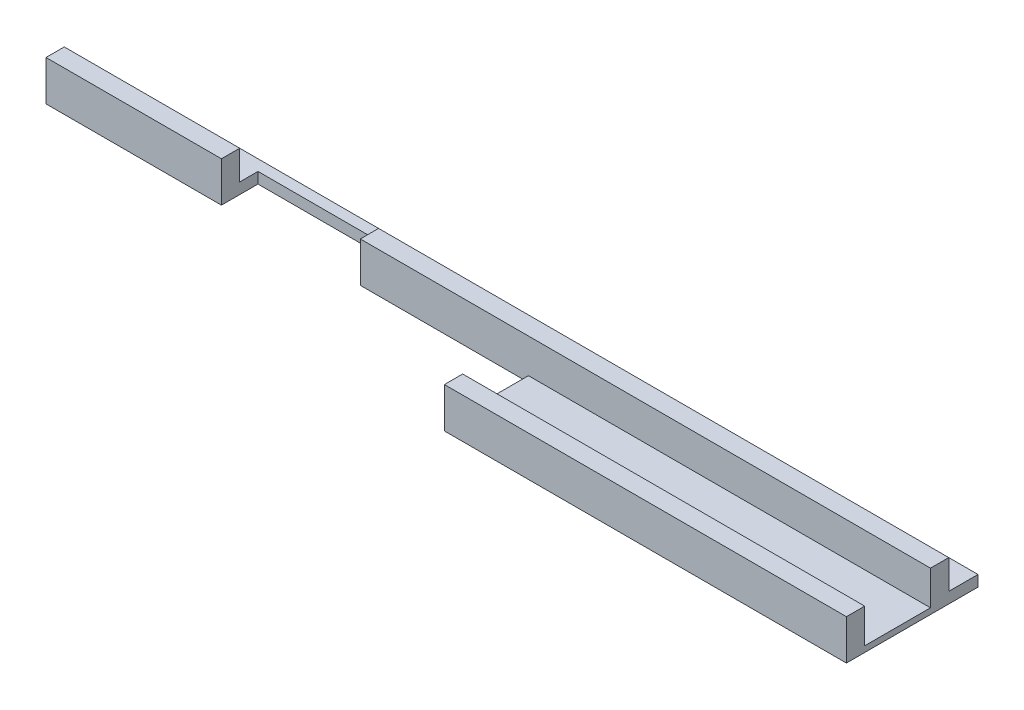
ISO-10303-21;
HEADER;
FILE_DESCRIPTION(('STEP AP214'),'2;1');
FILE_NAME('part.step','',(''),(''),'','','');
FILE_SCHEMA(('AUTOMOTIVE_DESIGN { 1 0 10303 214 1 1 1 1 }'));
ENDSEC;
DATA;
#1=APPLICATION_CONTEXT('core data for automotive mechanical design processes');
#2=APPLICATION_PROTOCOL_DEFINITION('international standard','automotive_design',2000,#1);
#3=PRODUCT_CONTEXT('',#1,'mechanical');
#4=PRODUCT('Part','Part','',(#3));
#5=PRODUCT_RELATED_PRODUCT_CATEGORY('part','',(#4));
#6=PRODUCT_DEFINITION_FORMATION('','',#4);
#7=PRODUCT_DEFINITION_CONTEXT('part definition',#1,'design');
#8=PRODUCT_DEFINITION('design','',#6,#7);
#9=PRODUCT_DEFINITION_SHAPE('','',#8);
#10=(LENGTH_UNIT() NAMED_UNIT(*) SI_UNIT(.MILLI.,.METRE.));
#11=(NAMED_UNIT(*) PLANE_ANGLE_UNIT() SI_UNIT($,.RADIAN.));
#12=(NAMED_UNIT(*) SI_UNIT($,.STERADIAN.) SOLID_ANGLE_UNIT());
#13=UNCERTAINTY_MEASURE_WITH_UNIT(LENGTH_MEASURE(1.E-05),#10,'distance_accuracy_value','');
#14=(GEOMETRIC_REPRESENTATION_CONTEXT(3) GLOBAL_UNCERTAINTY_ASSIGNED_CONTEXT((#13)) GLOBAL_UNIT_ASSIGNED_CONTEXT((#10,
#11,#12)) REPRESENTATION_CONTEXT('',''));
#15=CARTESIAN_POINT('',(0.,0.,0.));
#16=DIRECTION('',(0.,0.,1.));
#17=DIRECTION('',(1.,0.,0.));
#18=AXIS2_PLACEMENT_3D('',#15,#16,#17);
#19=CARTESIAN_POINT('',(-60.,3.,68.5));
#20=DIRECTION('',(0.,0.,-1.));
#21=DIRECTION('',(-1.,0.,0.));
#22=AXIS2_PLACEMENT_3D('',#19,#20,#21);
#23=PLANE('',#22);
#24=DIRECTION('',(1.,0.,0.));
#25=VECTOR('',#24,1.);
#26=CARTESIAN_POINT('',(-60.,0.,68.5));
#27=LINE('',#26,#25);
#28=CARTESIAN_POINT('',(-67.,0.,68.5));
#29=VERTEX_POINT('',#28);
#30=CARTESIAN_POINT('',(-19.,0.,68.5));
#31=VERTEX_POINT('',#30);
#32=EDGE_CURVE('E204',#29,#31,#27,.T.);
#33=ORIENTED_EDGE('',*,*,#32,.T.);
#34=DIRECTION('',(0.,1.,0.));
#35=VECTOR('',#34,1.);
#36=CARTESIAN_POINT('',(-19.,-14.,68.5));
#37=LINE('',#36,#35);
#38=CARTESIAN_POINT('',(-19.,11.,68.5));
#39=VERTEX_POINT('',#38);
#40=EDGE_CURVE('E277',#31,#39,#37,.T.);
#41=ORIENTED_EDGE('',*,*,#40,.T.);
#42=DIRECTION('',(1.,0.,0.));
#43=VECTOR('',#42,1.);
#44=CARTESIAN_POINT('',(-60.,11.,68.5));
#45=LINE('',#44,#43);
#46=CARTESIAN_POINT('',(-67.,11.,68.5));
#47=VERTEX_POINT('',#46);
#48=EDGE_CURVE('E265',#47,#39,#45,.T.);
#49=ORIENTED_EDGE('',*,*,#48,.F.);
#50=DIRECTION('',(0.,1.,0.));
#51=VECTOR('',#50,1.);
#52=CARTESIAN_POINT('',(-67.,11.,68.5));
#53=LINE('',#52,#51);
#54=EDGE_CURVE('E296',#29,#47,#53,.T.);
#55=ORIENTED_EDGE('',*,*,#54,.F.);
#56=EDGE_LOOP('',(#33,#41,#49,#55));
#57=FACE_BOUND('',#56,.T.);
#58=ADVANCED_FACE('F39',(#57),#23,.F.);
#59=CARTESIAN_POINT('',(-60.,11.,63.5));
#60=DIRECTION('',(0.,0.,1.));
#61=DIRECTION('',(1.,0.,0.));
#62=AXIS2_PLACEMENT_3D('',#59,#60,#61);
#63=PLANE('',#62);
#64=DIRECTION('',(-1.,0.,0.));
#65=VECTOR('',#64,1.);
#66=CARTESIAN_POINT('',(-60.,11.,63.5));
#67=LINE('',#66,#65);
#68=CARTESIAN_POINT('',(-19.,11.,63.5));
#69=VERTEX_POINT('',#68);
#70=CARTESIAN_POINT('',(-67.,11.,63.5));
#71=VERTEX_POINT('',#70);
#72=EDGE_CURVE('E183',#69,#71,#67,.T.);
#73=ORIENTED_EDGE('',*,*,#72,.F.);
#74=DIRECTION('',(0.,-1.,0.));
#75=VECTOR('',#74,1.);
#76=CARTESIAN_POINT('',(-19.,11.,63.5));
#77=LINE('',#76,#75);
#78=CARTESIAN_POINT('',(-19.,3.,63.5));
#79=VERTEX_POINT('',#78);
#80=EDGE_CURVE('E167',#69,#79,#77,.T.);
#81=ORIENTED_EDGE('',*,*,#80,.T.);
#82=DIRECTION('',(-1.,0.,0.));
#83=VECTOR('',#82,1.);
#84=CARTESIAN_POINT('',(-60.,3.,63.5));
#85=LINE('',#84,#83);
#86=CARTESIAN_POINT('',(-67.,3.,63.5));
#87=VERTEX_POINT('',#86);
#88=EDGE_CURVE('E181',#79,#87,#85,.T.);
#89=ORIENTED_EDGE('',*,*,#88,.T.);
#90=DIRECTION('',(0.,-1.,0.));
#91=VECTOR('',#90,1.);
#92=CARTESIAN_POINT('',(-67.,11.,63.5));
#93=LINE('',#92,#91);
#94=EDGE_CURVE('E310',#71,#87,#93,.T.);
#95=ORIENTED_EDGE('',*,*,#94,.F.);
#96=EDGE_LOOP('',(#73,#81,#89,#95));
#97=FACE_BOUND('',#96,.T.);
#98=ADVANCED_FACE('F179',(#97),#63,.F.);
#99=CARTESIAN_POINT('',(0.,11.,0.));
#100=DIRECTION('',(0.,-1.,0.));
#101=DIRECTION('',(0.,0.,-1.));
#102=AXIS2_PLACEMENT_3D('',#99,#100,#101);
#103=PLANE('',#102);
#104=ORIENTED_EDGE('',*,*,#48,.T.);
#105=DIRECTION('',(0.,0.,-1.));
#106=VECTOR('',#105,1.);
#107=CARTESIAN_POINT('',(-19.,11.,0.));
#108=LINE('',#107,#106);
#109=EDGE_CURVE('E208',#39,#69,#108,.T.);
#110=ORIENTED_EDGE('',*,*,#109,.T.);
#111=ORIENTED_EDGE('',*,*,#72,.T.);
#112=DIRECTION('',(0.,0.,-1.));
#113=VECTOR('',#112,1.);
#114=CARTESIAN_POINT('',(-67.,11.,63.5));
#115=LINE('',#114,#113);
#116=EDGE_CURVE('E313',#47,#71,#115,.T.);
#117=ORIENTED_EDGE('',*,*,#116,.F.);
#118=EDGE_LOOP('',(#104,#110,#111,#117));
#119=FACE_BOUND('',#118,.T.);
#120=ADVANCED_FACE('F378',(#119),#103,.F.);
#121=CARTESIAN_POINT('',(0.,3.,0.));
#122=DIRECTION('',(0.,-1.,0.));
#123=DIRECTION('',(0.,0.,-1.));
#124=AXIS2_PLACEMENT_3D('',#121,#122,#123);
#125=PLANE('',#124);
#126=CARTESIAN_POINT('',(175.,3.,63.5));
#127=VERTEX_POINT('',#126);
#128=CARTESIAN_POINT('',(19.,3.,63.5));
#129=VERTEX_POINT('',#128);
#130=EDGE_CURVE('E192',#127,#129,#85,.T.);
#131=ORIENTED_EDGE('',*,*,#130,.F.);
#132=DIRECTION('',(0.,0.,1.));
#133=VECTOR('',#132,1.);
#134=CARTESIAN_POINT('',(175.,3.,0.));
#135=LINE('',#134,#133);
#136=CARTESIAN_POINT('',(175.,3.,55.5));
#137=VERTEX_POINT('',#136);
#138=EDGE_CURVE('E241',#137,#127,#135,.T.);
#139=ORIENTED_EDGE('',*,*,#138,.F.);
#140=DIRECTION('',(-1.,0.,0.));
#141=VECTOR('',#140,1.);
#142=CARTESIAN_POINT('',(0.,3.,55.5));
#143=LINE('',#142,#141);
#144=CARTESIAN_POINT('',(-67.,3.,55.5));
#145=VERTEX_POINT('',#144);
#146=EDGE_CURVE('E95',#137,#145,#143,.T.);
#147=ORIENTED_EDGE('',*,*,#146,.T.);
#148=DIRECTION('',(0.,0.,-1.));
#149=VECTOR('',#148,1.);
#150=CARTESIAN_POINT('',(-67.,3.,63.5));
#151=LINE('',#150,#149);
#152=EDGE_CURVE('E190',#87,#145,#151,.T.);
#153=ORIENTED_EDGE('',*,*,#152,.F.);
#154=ORIENTED_EDGE('',*,*,#88,.F.);
#155=DIRECTION('',(0.,0.,-1.));
#156=VECTOR('',#155,1.);
#157=CARTESIAN_POINT('',(-19.,3.,0.));
#158=LINE('',#157,#156);
#159=CARTESIAN_POINT('',(-19.,3.,58.5));
#160=VERTEX_POINT('',#159);
#161=EDGE_CURVE('E164',#79,#160,#158,.T.);
#162=ORIENTED_EDGE('',*,*,#161,.T.);
#163=DIRECTION('',(1.,0.,0.));
#164=VECTOR('',#163,1.);
#165=CARTESIAN_POINT('',(0.,3.,58.5));
#166=LINE('',#165,#164);
#167=CARTESIAN_POINT('',(19.,3.,58.5));
#168=VERTEX_POINT('',#167);
#169=EDGE_CURVE('E193',#160,#168,#166,.T.);
#170=ORIENTED_EDGE('',*,*,#169,.T.);
#171=DIRECTION('',(0.,0.,1.));
#172=VECTOR('',#171,1.);
#173=CARTESIAN_POINT('',(19.,3.,0.));
#174=LINE('',#173,#172);
#175=EDGE_CURVE('E249',#168,#129,#174,.T.);
#176=ORIENTED_EDGE('',*,*,#175,.T.);
#177=EDGE_LOOP('',(#131,#139,#147,#153,#154,#162,#170,#176));
#178=FACE_BOUND('',#177,.T.);
#179=ADVANCED_FACE('F188',(#178),#125,.F.);
#180=DIRECTION('',(0.,-1.,0.));
#181=VECTOR('',#180,1.);
#182=CARTESIAN_POINT('',(175.,3.,68.5));
#183=LINE('',#182,#181);
#184=CARTESIAN_POINT('',(175.,11.,68.5));
#185=VERTEX_POINT('',#184);
#186=CARTESIAN_POINT('',(175.,1.6,68.5));
#187=VERTEX_POINT('',#186);
#188=EDGE_CURVE('E231',#185,#187,#183,.T.);
#189=ORIENTED_EDGE('',*,*,#188,.F.);
#190=CARTESIAN_POINT('',(19.,11.,68.5));
#191=VERTEX_POINT('',#190);
#192=EDGE_CURVE('E198',#191,#185,#45,.T.);
#193=ORIENTED_EDGE('',*,*,#192,.F.);
#194=DIRECTION('',(0.,1.,0.));
#195=VECTOR('',#194,1.);
#196=CARTESIAN_POINT('',(19.,-14.,68.5));
#197=LINE('',#196,#195);
#198=CARTESIAN_POINT('',(19.,0.,68.5));
#199=VERTEX_POINT('',#198);
#200=EDGE_CURVE('E281',#199,#191,#197,.T.);
#201=ORIENTED_EDGE('',*,*,#200,.F.);
#202=CARTESIAN_POINT('',(65.,0.,68.5));
#203=VERTEX_POINT('',#202);
#204=EDGE_CURVE('E209',#199,#203,#27,.T.);
#205=ORIENTED_EDGE('',*,*,#204,.T.);
#206=DIRECTION('',(0.,1.,0.));
#207=VECTOR('',#206,1.);
#208=CARTESIAN_POINT('',(65.,-239.,68.5));
#209=LINE('',#208,#207);
#210=CARTESIAN_POINT('',(65.,1.59999999999999,68.5));
#211=VERTEX_POINT('',#210);
#212=EDGE_CURVE('E343',#203,#211,#209,.T.);
#213=ORIENTED_EDGE('',*,*,#212,.T.);
#214=DIRECTION('',(-1.,0.,0.));
#215=VECTOR('',#214,1.);
#216=CARTESIAN_POINT('',(180.,1.6,68.5));
#217=LINE('',#216,#215);
#218=EDGE_CURVE('E317',#187,#211,#217,.T.);
#219=ORIENTED_EDGE('',*,*,#218,.F.);
#220=EDGE_LOOP('',(#189,#193,#201,#205,#213,#219));
#221=FACE_BOUND('',#220,.T.);
#222=ADVANCED_FACE('F370',(#221),#23,.F.);
#223=CARTESIAN_POINT('',(0.,0.,0.));
#224=DIRECTION('',(0.,-1.,0.));
#225=DIRECTION('',(0.,0.,-1.));
#226=AXIS2_PLACEMENT_3D('',#223,#224,#225);
#227=PLANE('',#226);
#228=DIRECTION('',(0.,0.,1.));
#229=VECTOR('',#228,1.);
#230=CARTESIAN_POINT('',(65.,0.,0.));
#231=LINE('',#230,#229);
#232=CARTESIAN_POINT('',(65.,0.,91.5));
#233=VERTEX_POINT('',#232);
#234=EDGE_CURVE('E59',#203,#233,#231,.T.);
#235=ORIENTED_EDGE('',*,*,#234,.F.);
#236=ORIENTED_EDGE('',*,*,#204,.F.);
#237=DIRECTION('',(0.,0.,1.));
#238=VECTOR('',#237,1.);
#239=CARTESIAN_POINT('',(19.,0.,0.));
#240=LINE('',#239,#238);
#241=CARTESIAN_POINT('',(19.,0.,58.5));
#242=VERTEX_POINT('',#241);
#243=EDGE_CURVE('E185',#242,#199,#240,.T.);
#244=ORIENTED_EDGE('',*,*,#243,.F.);
#245=DIRECTION('',(1.,0.,0.));
#246=VECTOR('',#245,1.);
#247=CARTESIAN_POINT('',(0.,0.,58.5));
#248=LINE('',#247,#246);
#249=CARTESIAN_POINT('',(-19.,0.,58.5));
#250=VERTEX_POINT('',#249);
#251=EDGE_CURVE('E50',#250,#242,#248,.T.);
#252=ORIENTED_EDGE('',*,*,#251,.F.);
#253=DIRECTION('',(0.,0.,-1.));
#254=VECTOR('',#253,1.);
#255=CARTESIAN_POINT('',(-19.,0.,0.));
#256=LINE('',#255,#254);
#257=EDGE_CURVE('E175',#31,#250,#256,.T.);
#258=ORIENTED_EDGE('',*,*,#257,.F.);
#259=ORIENTED_EDGE('',*,*,#32,.F.);
#260=DIRECTION('',(0.,0.,1.));
#261=VECTOR('',#260,1.);
#262=CARTESIAN_POINT('',(-67.,0.,68.5));
#263=LINE('',#262,#261);
#264=CARTESIAN_POINT('',(-67.,0.,55.5));
#265=VERTEX_POINT('',#264);
#266=EDGE_CURVE('E300',#265,#29,#263,.T.);
#267=ORIENTED_EDGE('',*,*,#266,.F.);
#268=DIRECTION('',(1.,0.,0.));
#269=VECTOR('',#268,1.);
#270=CARTESIAN_POINT('',(-60.,0.,55.5));
#271=LINE('',#270,#269);
#272=CARTESIAN_POINT('',(175.,0.,55.5));
#273=VERTEX_POINT('',#272);
#274=EDGE_CURVE('E103',#265,#273,#271,.T.);
#275=ORIENTED_EDGE('',*,*,#274,.T.);
#276=DIRECTION('',(0.,0.,-1.));
#277=VECTOR('',#276,1.);
#278=CARTESIAN_POINT('',(175.,0.,0.));
#279=LINE('',#278,#277);
#280=CARTESIAN_POINT('',(175.,0.,91.5));
#281=VERTEX_POINT('',#280);
#282=EDGE_CURVE('E214',#281,#273,#279,.T.);
#283=ORIENTED_EDGE('',*,*,#282,.F.);
#284=DIRECTION('',(-1.,0.,0.));
#285=VECTOR('',#284,1.);
#286=CARTESIAN_POINT('',(180.,0.,91.5));
#287=LINE('',#286,#285);
#288=EDGE_CURVE('E221',#281,#233,#287,.T.);
#289=ORIENTED_EDGE('',*,*,#288,.T.);
#290=EDGE_LOOP('',(#235,#236,#244,#252,#258,#259,#267,#275,#283,#289));
#291=FACE_BOUND('',#290,.T.);
#292=ADVANCED_FACE('F385',(#291),#227,.T.);
#293=ORIENTED_EDGE('',*,*,#130,.T.);
#294=DIRECTION('',(0.,1.,0.));
#295=VECTOR('',#294,1.);
#296=CARTESIAN_POINT('',(19.,11.,63.5));
#297=LINE('',#296,#295);
#298=CARTESIAN_POINT('',(19.,11.,63.5));
#299=VERTEX_POINT('',#298);
#300=EDGE_CURVE('E253',#129,#299,#297,.T.);
#301=ORIENTED_EDGE('',*,*,#300,.T.);
#302=CARTESIAN_POINT('',(175.,11.,63.5));
#303=VERTEX_POINT('',#302);
#304=EDGE_CURVE('E202',#303,#299,#67,.T.);
#305=ORIENTED_EDGE('',*,*,#304,.F.);
#306=DIRECTION('',(0.,1.,0.));
#307=VECTOR('',#306,1.);
#308=CARTESIAN_POINT('',(175.,11.,63.5));
#309=LINE('',#308,#307);
#310=EDGE_CURVE('E238',#127,#303,#309,.T.);
#311=ORIENTED_EDGE('',*,*,#310,.F.);
#312=EDGE_LOOP('',(#293,#301,#305,#311));
#313=FACE_BOUND('',#312,.T.);
#314=ADVANCED_FACE('F252',(#313),#63,.F.);
#315=ORIENTED_EDGE('',*,*,#304,.T.);
#316=DIRECTION('',(0.,0.,-1.));
#317=VECTOR('',#316,1.);
#318=CARTESIAN_POINT('',(19.,11.,58.5));
#319=LINE('',#318,#317);
#320=EDGE_CURVE('E261',#191,#299,#319,.T.);
#321=ORIENTED_EDGE('',*,*,#320,.F.);
#322=ORIENTED_EDGE('',*,*,#192,.T.);
#323=DIRECTION('',(0.,0.,1.));
#324=VECTOR('',#323,1.);
#325=CARTESIAN_POINT('',(175.,11.,0.));
#326=LINE('',#325,#324);
#327=EDGE_CURVE('E234',#303,#185,#326,.T.);
#328=ORIENTED_EDGE('',*,*,#327,.F.);
#329=EDGE_LOOP('',(#315,#321,#322,#328));
#330=FACE_BOUND('',#329,.T.);
#331=ADVANCED_FACE('F258',(#330),#103,.F.);
#332=CARTESIAN_POINT('',(-19.,-14.,58.5));
#333=DIRECTION('',(0.,0.,-1.));
#334=DIRECTION('',(-1.,0.,0.));
#335=AXIS2_PLACEMENT_3D('',#332,#333,#334);
#336=PLANE('',#335);
#337=DIRECTION('',(0.,1.,0.));
#338=VECTOR('',#337,1.);
#339=CARTESIAN_POINT('',(-19.,-14.,58.5));
#340=LINE('',#339,#338);
#341=EDGE_CURVE('E170',#250,#160,#340,.T.);
#342=ORIENTED_EDGE('',*,*,#341,.F.);
#343=ORIENTED_EDGE('',*,*,#251,.T.);
#344=DIRECTION('',(0.,1.,0.));
#345=VECTOR('',#344,1.);
#346=CARTESIAN_POINT('',(19.,-14.,58.5));
#347=LINE('',#346,#345);
#348=EDGE_CURVE('E284',#242,#168,#347,.T.);
#349=ORIENTED_EDGE('',*,*,#348,.T.);
#350=ORIENTED_EDGE('',*,*,#169,.F.);
#351=EDGE_LOOP('',(#342,#343,#349,#350));
#352=FACE_BOUND('',#351,.T.);
#353=ADVANCED_FACE('F388',(#352),#336,.F.);
#354=CARTESIAN_POINT('',(-19.,-14.,58.5));
#355=DIRECTION('',(-1.,0.,0.));
#356=DIRECTION('',(0.,0.,1.));
#357=AXIS2_PLACEMENT_3D('',#354,#355,#356);
#358=PLANE('',#357);
#359=ORIENTED_EDGE('',*,*,#257,.T.);
#360=ORIENTED_EDGE('',*,*,#341,.T.);
#361=ORIENTED_EDGE('',*,*,#161,.F.);
#362=ORIENTED_EDGE('',*,*,#80,.F.);
#363=ORIENTED_EDGE('',*,*,#109,.F.);
#364=ORIENTED_EDGE('',*,*,#40,.F.);
#365=EDGE_LOOP('',(#359,#360,#361,#362,#363,#364));
#366=FACE_BOUND('',#365,.T.);
#367=ADVANCED_FACE('F166',(#366),#358,.F.);
#368=CARTESIAN_POINT('',(19.,-14.,58.5));
#369=DIRECTION('',(1.,0.,0.));
#370=DIRECTION('',(0.,0.,-1.));
#371=AXIS2_PLACEMENT_3D('',#368,#369,#370);
#372=PLANE('',#371);
#373=ORIENTED_EDGE('',*,*,#243,.T.);
#374=ORIENTED_EDGE('',*,*,#200,.T.);
#375=ORIENTED_EDGE('',*,*,#320,.T.);
#376=ORIENTED_EDGE('',*,*,#300,.F.);
#377=ORIENTED_EDGE('',*,*,#175,.F.);
#378=ORIENTED_EDGE('',*,*,#348,.F.);
#379=EDGE_LOOP('',(#373,#374,#375,#376,#377,#378));
#380=FACE_BOUND('',#379,.T.);
#381=ADVANCED_FACE('F390',(#380),#372,.F.);
#382=CARTESIAN_POINT('',(-60.,0.,55.5));
#383=DIRECTION('',(0.,0.,1.));
#384=DIRECTION('',(1.,0.,0.));
#385=AXIS2_PLACEMENT_3D('',#382,#383,#384);
#386=PLANE('',#385);
#387=ORIENTED_EDGE('',*,*,#146,.F.);
#388=DIRECTION('',(0.,1.,0.));
#389=VECTOR('',#388,1.);
#390=CARTESIAN_POINT('',(175.,0.,55.5));
#391=LINE('',#390,#389);
#392=EDGE_CURVE('E43',#273,#137,#391,.T.);
#393=ORIENTED_EDGE('',*,*,#392,.F.);
#394=ORIENTED_EDGE('',*,*,#274,.F.);
#395=DIRECTION('',(0.,-1.,0.));
#396=VECTOR('',#395,1.);
#397=CARTESIAN_POINT('',(-67.,0.,55.5));
#398=LINE('',#397,#396);
#399=EDGE_CURVE('E304',#145,#265,#398,.T.);
#400=ORIENTED_EDGE('',*,*,#399,.F.);
#401=EDGE_LOOP('',(#387,#393,#394,#400));
#402=FACE_BOUND('',#401,.T.);
#403=ADVANCED_FACE('F392',(#402),#386,.F.);
#404=CARTESIAN_POINT('',(-67.,0.,0.));
#405=DIRECTION('',(1.,0.,0.));
#406=DIRECTION('',(0.,0.,-1.));
#407=AXIS2_PLACEMENT_3D('',#404,#405,#406);
#408=PLANE('',#407);
#409=ORIENTED_EDGE('',*,*,#116,.T.);
#410=ORIENTED_EDGE('',*,*,#94,.T.);
#411=ORIENTED_EDGE('',*,*,#152,.T.);
#412=ORIENTED_EDGE('',*,*,#399,.T.);
#413=ORIENTED_EDGE('',*,*,#266,.T.);
#414=ORIENTED_EDGE('',*,*,#54,.T.);
#415=EDGE_LOOP('',(#409,#410,#411,#412,#413,#414));
#416=FACE_BOUND('',#415,.T.);
#417=ADVANCED_FACE('F380',(#416),#408,.F.);
#418=CARTESIAN_POINT('',(180.,1.6,68.5));
#419=DIRECTION('',(0.,-1.,0.));
#420=DIRECTION('',(0.,0.,-1.));
#421=AXIS2_PLACEMENT_3D('',#418,#419,#420);
#422=PLANE('',#421);
#423=ORIENTED_EDGE('',*,*,#218,.T.);
#424=DIRECTION('',(0.,0.,1.));
#425=VECTOR('',#424,1.);
#426=CARTESIAN_POINT('',(65.,1.6,68.5));
#427=LINE('',#426,#425);
#428=CARTESIAN_POINT('',(65.,1.6,86.5));
#429=VERTEX_POINT('',#428);
#430=EDGE_CURVE('E338',#211,#429,#427,.T.);
#431=ORIENTED_EDGE('',*,*,#430,.T.);
#432=DIRECTION('',(-1.,0.,0.));
#433=VECTOR('',#432,1.);
#434=CARTESIAN_POINT('',(180.,1.6,86.5));
#435=LINE('',#434,#433);
#436=CARTESIAN_POINT('',(175.,1.6,86.5));
#437=VERTEX_POINT('',#436);
#438=EDGE_CURVE('E321',#437,#429,#435,.T.);
#439=ORIENTED_EDGE('',*,*,#438,.F.);
#440=DIRECTION('',(0.,0.,1.));
#441=VECTOR('',#440,1.);
#442=CARTESIAN_POINT('',(175.,1.6,68.5));
#443=LINE('',#442,#441);
#444=EDGE_CURVE('E228',#187,#437,#443,.T.);
#445=ORIENTED_EDGE('',*,*,#444,.F.);
#446=EDGE_LOOP('',(#423,#431,#439,#445));
#447=FACE_BOUND('',#446,.T.);
#448=ADVANCED_FACE('F368',(#447),#422,.F.);
#449=CARTESIAN_POINT('',(180.,1.6,86.5));
#450=DIRECTION('',(0.,0.,1.));
#451=DIRECTION('',(1.,0.,0.));
#452=AXIS2_PLACEMENT_3D('',#449,#450,#451);
#453=PLANE('',#452);
#454=ORIENTED_EDGE('',*,*,#438,.T.);
#455=DIRECTION('',(0.,1.,0.));
#456=VECTOR('',#455,1.);
#457=CARTESIAN_POINT('',(65.,1.6,86.5));
#458=LINE('',#457,#456);
#459=CARTESIAN_POINT('',(65.,11.,86.5));
#460=VERTEX_POINT('',#459);
#461=EDGE_CURVE('E110',#429,#460,#458,.T.);
#462=ORIENTED_EDGE('',*,*,#461,.T.);
#463=DIRECTION('',(-1.,0.,0.));
#464=VECTOR('',#463,1.);
#465=CARTESIAN_POINT('',(180.,11.,86.5));
#466=LINE('',#465,#464);
#467=CARTESIAN_POINT('',(175.,11.,86.5));
#468=VERTEX_POINT('',#467);
#469=EDGE_CURVE('E325',#468,#460,#466,.T.);
#470=ORIENTED_EDGE('',*,*,#469,.F.);
#471=DIRECTION('',(0.,1.,0.));
#472=VECTOR('',#471,1.);
#473=CARTESIAN_POINT('',(175.,1.6,86.5));
#474=LINE('',#473,#472);
#475=EDGE_CURVE('E225',#437,#468,#474,.T.);
#476=ORIENTED_EDGE('',*,*,#475,.F.);
#477=EDGE_LOOP('',(#454,#462,#470,#476));
#478=FACE_BOUND('',#477,.T.);
#479=ADVANCED_FACE('F358',(#478),#453,.F.);
#480=CARTESIAN_POINT('',(180.,11.,86.5));
#481=DIRECTION('',(0.,-1.,0.));
#482=DIRECTION('',(0.,0.,-1.));
#483=AXIS2_PLACEMENT_3D('',#480,#481,#482);
#484=PLANE('',#483);
#485=ORIENTED_EDGE('',*,*,#469,.T.);
#486=DIRECTION('',(0.,0.,-1.));
#487=VECTOR('',#486,1.);
#488=CARTESIAN_POINT('',(65.,11.,68.5));
#489=LINE('',#488,#487);
#490=CARTESIAN_POINT('',(65.,11.,91.5));
#491=VERTEX_POINT('',#490);
#492=EDGE_CURVE('E347',#491,#460,#489,.T.);
#493=ORIENTED_EDGE('',*,*,#492,.F.);
#494=DIRECTION('',(-1.,0.,0.));
#495=VECTOR('',#494,1.);
#496=CARTESIAN_POINT('',(180.,11.,91.5));
#497=LINE('',#496,#495);
#498=CARTESIAN_POINT('',(175.,11.,91.5));
#499=VERTEX_POINT('',#498);
#500=EDGE_CURVE('E329',#499,#491,#497,.T.);
#501=ORIENTED_EDGE('',*,*,#500,.F.);
#502=DIRECTION('',(0.,0.,1.));
#503=VECTOR('',#502,1.);
#504=CARTESIAN_POINT('',(175.,11.,86.5));
#505=LINE('',#504,#503);
#506=EDGE_CURVE('E222',#468,#499,#505,.T.);
#507=ORIENTED_EDGE('',*,*,#506,.F.);
#508=EDGE_LOOP('',(#485,#493,#501,#507));
#509=FACE_BOUND('',#508,.T.);
#510=ADVANCED_FACE('F362',(#509),#484,.F.);
#511=CARTESIAN_POINT('',(180.,11.,91.5));
#512=DIRECTION('',(0.,0.,-1.));
#513=DIRECTION('',(-1.,0.,0.));
#514=AXIS2_PLACEMENT_3D('',#511,#512,#513);
#515=PLANE('',#514);
#516=ORIENTED_EDGE('',*,*,#500,.T.);
#517=DIRECTION('',(0.,-1.,0.));
#518=VECTOR('',#517,1.);
#519=CARTESIAN_POINT('',(65.,11.,91.5));
#520=LINE('',#519,#518);
#521=EDGE_CURVE('E12',#491,#233,#520,.T.);
#522=ORIENTED_EDGE('',*,*,#521,.T.);
#523=ORIENTED_EDGE('',*,*,#288,.F.);
#524=DIRECTION('',(0.,-1.,0.));
#525=VECTOR('',#524,1.);
#526=CARTESIAN_POINT('',(175.,11.,91.5));
#527=LINE('',#526,#525);
#528=EDGE_CURVE('E218',#499,#281,#527,.T.);
#529=ORIENTED_EDGE('',*,*,#528,.F.);
#530=EDGE_LOOP('',(#516,#522,#523,#529));
#531=FACE_BOUND('',#530,.T.);
#532=ADVANCED_FACE('F434',(#531),#515,.F.);
#533=CARTESIAN_POINT('',(175.,0.,0.));
#534=DIRECTION('',(1.,0.,0.));
#535=DIRECTION('',(0.,0.,-1.));
#536=AXIS2_PLACEMENT_3D('',#533,#534,#535);
#537=PLANE('',#536);
#538=ORIENTED_EDGE('',*,*,#282,.T.);
#539=ORIENTED_EDGE('',*,*,#392,.T.);
#540=ORIENTED_EDGE('',*,*,#138,.T.);
#541=ORIENTED_EDGE('',*,*,#310,.T.);
#542=ORIENTED_EDGE('',*,*,#327,.T.);
#543=ORIENTED_EDGE('',*,*,#188,.T.);
#544=ORIENTED_EDGE('',*,*,#444,.T.);
#545=ORIENTED_EDGE('',*,*,#475,.T.);
#546=ORIENTED_EDGE('',*,*,#506,.T.);
#547=ORIENTED_EDGE('',*,*,#528,.T.);
#548=EDGE_LOOP('',(#538,#539,#540,#541,#542,#543,#544,#545,#546,#547));
#549=FACE_BOUND('',#548,.T.);
#550=ADVANCED_FACE('F41',(#549),#537,.T.);
#551=CARTESIAN_POINT('',(65.,-239.,68.5));
#552=DIRECTION('',(1.,0.,0.));
#553=DIRECTION('',(0.,0.,-1.));
#554=AXIS2_PLACEMENT_3D('',#551,#552,#553);
#555=PLANE('',#554);
#556=ORIENTED_EDGE('',*,*,#234,.T.);
#557=ORIENTED_EDGE('',*,*,#521,.F.);
#558=ORIENTED_EDGE('',*,*,#492,.T.);
#559=ORIENTED_EDGE('',*,*,#461,.F.);
#560=ORIENTED_EDGE('',*,*,#430,.F.);
#561=ORIENTED_EDGE('',*,*,#212,.F.);
#562=EDGE_LOOP('',(#556,#557,#558,#559,#560,#561));
#563=FACE_BOUND('',#562,.T.);
#564=ADVANCED_FACE('F351',(#563),#555,.F.);
#565=CLOSED_SHELL('',(#58,#98,#120,#179,#222,#292,#314,#331,#353,#367,#381,#403,#417,#448,#479,
#510,#532,#550,#564));
#566=MANIFOLD_SOLID_BREP('B2',#565);
#567=ADVANCED_BREP_SHAPE_REPRESENTATION('',(#18,#566),#14);
#568=SHAPE_DEFINITION_REPRESENTATION(#9,#567);
ENDSEC;
END-ISO-10303-21;
